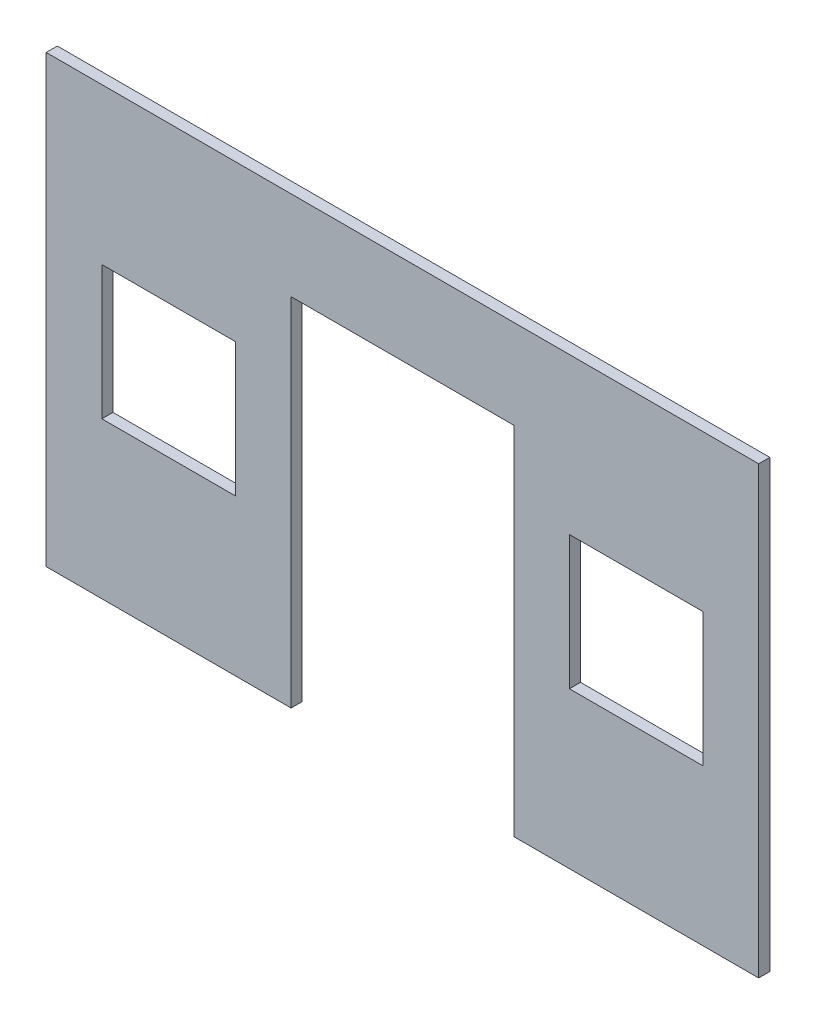
ISO-10303-21;
HEADER;
FILE_DESCRIPTION(('STEP AP214'),'2;1');
FILE_NAME('part.step','',(''),(''),'','','');
FILE_SCHEMA(('AUTOMOTIVE_DESIGN { 1 0 10303 214 1 1 1 1 }'));
ENDSEC;
DATA;
#1=APPLICATION_CONTEXT('core data for automotive mechanical design processes');
#2=APPLICATION_PROTOCOL_DEFINITION('international standard','automotive_design',2000,#1);
#3=PRODUCT_CONTEXT('',#1,'mechanical');
#4=PRODUCT('Part','Part','',(#3));
#5=PRODUCT_RELATED_PRODUCT_CATEGORY('part','',(#4));
#6=PRODUCT_DEFINITION_FORMATION('','',#4);
#7=PRODUCT_DEFINITION_CONTEXT('part definition',#1,'design');
#8=PRODUCT_DEFINITION('design','',#6,#7);
#9=PRODUCT_DEFINITION_SHAPE('','',#8);
#10=(LENGTH_UNIT() NAMED_UNIT(*) SI_UNIT(.MILLI.,.METRE.));
#11=(NAMED_UNIT(*) PLANE_ANGLE_UNIT() SI_UNIT($,.RADIAN.));
#12=(NAMED_UNIT(*) SI_UNIT($,.STERADIAN.) SOLID_ANGLE_UNIT());
#13=UNCERTAINTY_MEASURE_WITH_UNIT(LENGTH_MEASURE(1.E-05),#10,'distance_accuracy_value','');
#14=(GEOMETRIC_REPRESENTATION_CONTEXT(3) GLOBAL_UNCERTAINTY_ASSIGNED_CONTEXT((#13)) GLOBAL_UNIT_ASSIGNED_CONTEXT((#10,
#11,#12)) REPRESENTATION_CONTEXT('',''));
#15=CARTESIAN_POINT('',(0.,0.,0.));
#16=DIRECTION('',(0.,0.,1.));
#17=DIRECTION('',(1.,0.,0.));
#18=AXIS2_PLACEMENT_3D('',#15,#16,#17);
#19=CARTESIAN_POINT('',(-203.2,0.,6.35));
#20=DIRECTION('',(0.,1.,0.));
#21=DIRECTION('',(-1.,0.,0.));
#22=AXIS2_PLACEMENT_3D('',#19,#20,#21);
#23=PLANE('',#22);
#24=DIRECTION('',(1.,0.,0.));
#25=VECTOR('',#24,1.);
#26=CARTESIAN_POINT('',(-203.2,0.,0.));
#27=LINE('',#26,#25);
#28=CARTESIAN_POINT('',(-203.2,0.,0.));
#29=VERTEX_POINT('',#28);
#30=CARTESIAN_POINT('',(-63.5,0.,0.));
#31=VERTEX_POINT('',#30);
#32=EDGE_CURVE('E254',#29,#31,#27,.T.);
#33=ORIENTED_EDGE('',*,*,#32,.T.);
#34=DIRECTION('',(0.,0.,1.));
#35=VECTOR('',#34,1.);
#36=CARTESIAN_POINT('',(-63.5,0.,-0.00100000000000013));
#37=LINE('',#36,#35);
#38=CARTESIAN_POINT('',(-63.5,0.,6.35));
#39=VERTEX_POINT('',#38);
#40=EDGE_CURVE('E228',#31,#39,#37,.T.);
#41=ORIENTED_EDGE('',*,*,#40,.T.);
#42=DIRECTION('',(1.,0.,0.));
#43=VECTOR('',#42,1.);
#44=CARTESIAN_POINT('',(-203.2,0.,6.35));
#45=LINE('',#44,#43);
#46=CARTESIAN_POINT('',(-203.2,0.,6.35));
#47=VERTEX_POINT('',#46);
#48=EDGE_CURVE('E243',#47,#39,#45,.T.);
#49=ORIENTED_EDGE('',*,*,#48,.F.);
#50=DIRECTION('',(0.,0.,-1.));
#51=VECTOR('',#50,1.);
#52=CARTESIAN_POINT('',(-203.2,0.,6.35));
#53=LINE('',#52,#51);
#54=EDGE_CURVE('E11',#47,#29,#53,.T.);
#55=ORIENTED_EDGE('',*,*,#54,.T.);
#56=EDGE_LOOP('',(#33,#41,#49,#55));
#57=FACE_BOUND('',#56,.T.);
#58=ADVANCED_FACE('F33',(#57),#23,.F.);
#59=CARTESIAN_POINT('',(-203.2,254.,6.35));
#60=DIRECTION('',(1.,0.,0.));
#61=DIRECTION('',(0.,1.,0.));
#62=AXIS2_PLACEMENT_3D('',#59,#60,#61);
#63=PLANE('',#62);
#64=DIRECTION('',(0.,-1.,0.));
#65=VECTOR('',#64,1.);
#66=CARTESIAN_POINT('',(-203.2,254.,0.));
#67=LINE('',#66,#65);
#68=CARTESIAN_POINT('',(-203.2,254.,0.));
#69=VERTEX_POINT('',#68);
#70=EDGE_CURVE('E231',#69,#29,#67,.T.);
#71=ORIENTED_EDGE('',*,*,#70,.T.);
#72=ORIENTED_EDGE('',*,*,#54,.F.);
#73=DIRECTION('',(0.,-1.,0.));
#74=VECTOR('',#73,1.);
#75=CARTESIAN_POINT('',(-203.2,254.,6.35));
#76=LINE('',#75,#74);
#77=CARTESIAN_POINT('',(-203.2,254.,6.35));
#78=VERTEX_POINT('',#77);
#79=EDGE_CURVE('E238',#78,#47,#76,.T.);
#80=ORIENTED_EDGE('',*,*,#79,.F.);
#81=DIRECTION('',(0.,0.,-1.));
#82=VECTOR('',#81,1.);
#83=CARTESIAN_POINT('',(-203.2,254.,6.35));
#84=LINE('',#83,#82);
#85=EDGE_CURVE('E250',#78,#69,#84,.T.);
#86=ORIENTED_EDGE('',*,*,#85,.T.);
#87=EDGE_LOOP('',(#71,#72,#80,#86));
#88=FACE_BOUND('',#87,.T.);
#89=ADVANCED_FACE('F35',(#88),#63,.F.);
#90=CARTESIAN_POINT('',(63.5,0.,6.35));
#91=VERTEX_POINT('',#90);
#92=CARTESIAN_POINT('',(203.2,0.,6.35));
#93=VERTEX_POINT('',#92);
#94=EDGE_CURVE('E241',#91,#93,#45,.T.);
#95=ORIENTED_EDGE('',*,*,#94,.F.);
#96=DIRECTION('',(0.,0.,1.));
#97=VECTOR('',#96,1.);
#98=CARTESIAN_POINT('',(63.5,0.,-0.00100000000000013));
#99=LINE('',#98,#97);
#100=CARTESIAN_POINT('',(63.5,0.,0.));
#101=VERTEX_POINT('',#100);
#102=EDGE_CURVE('E234',#101,#91,#99,.T.);
#103=ORIENTED_EDGE('',*,*,#102,.F.);
#104=CARTESIAN_POINT('',(203.2,0.,0.));
#105=VERTEX_POINT('',#104);
#106=EDGE_CURVE('E253',#101,#105,#27,.T.);
#107=ORIENTED_EDGE('',*,*,#106,.T.);
#108=DIRECTION('',(0.,0.,-1.));
#109=VECTOR('',#108,1.);
#110=CARTESIAN_POINT('',(203.2,0.,6.35));
#111=LINE('',#110,#109);
#112=EDGE_CURVE('E41',#93,#105,#111,.T.);
#113=ORIENTED_EDGE('',*,*,#112,.F.);
#114=EDGE_LOOP('',(#95,#103,#107,#113));
#115=FACE_BOUND('',#114,.T.);
#116=ADVANCED_FACE('F292',(#115),#23,.F.);
#117=CARTESIAN_POINT('',(203.2,254.,6.35));
#118=DIRECTION('',(-1.,0.,0.));
#119=DIRECTION('',(0.,-1.,0.));
#120=AXIS2_PLACEMENT_3D('',#117,#118,#119);
#121=PLANE('',#120);
#122=DIRECTION('',(0.,1.,0.));
#123=VECTOR('',#122,1.);
#124=CARTESIAN_POINT('',(203.2,254.,0.));
#125=LINE('',#124,#123);
#126=CARTESIAN_POINT('',(203.2,254.,0.));
#127=VERTEX_POINT('',#126);
#128=EDGE_CURVE('E257',#105,#127,#125,.T.);
#129=ORIENTED_EDGE('',*,*,#128,.T.);
#130=DIRECTION('',(0.,0.,-1.));
#131=VECTOR('',#130,1.);
#132=CARTESIAN_POINT('',(203.2,254.,6.35));
#133=LINE('',#132,#131);
#134=CARTESIAN_POINT('',(203.2,254.,6.35));
#135=VERTEX_POINT('',#134);
#136=EDGE_CURVE('E262',#135,#127,#133,.T.);
#137=ORIENTED_EDGE('',*,*,#136,.F.);
#138=DIRECTION('',(0.,1.,0.));
#139=VECTOR('',#138,1.);
#140=CARTESIAN_POINT('',(203.2,254.,6.35));
#141=LINE('',#140,#139);
#142=EDGE_CURVE('E246',#93,#135,#141,.T.);
#143=ORIENTED_EDGE('',*,*,#142,.F.);
#144=ORIENTED_EDGE('',*,*,#112,.T.);
#145=EDGE_LOOP('',(#129,#137,#143,#144));
#146=FACE_BOUND('',#145,.T.);
#147=ADVANCED_FACE('F269',(#146),#121,.F.);
#148=CARTESIAN_POINT('',(-203.2,254.,6.35));
#149=DIRECTION('',(0.,-1.,0.));
#150=DIRECTION('',(1.,0.,0.));
#151=AXIS2_PLACEMENT_3D('',#148,#149,#150);
#152=PLANE('',#151);
#153=DIRECTION('',(-1.,0.,0.));
#154=VECTOR('',#153,1.);
#155=CARTESIAN_POINT('',(-203.2,254.,0.));
#156=LINE('',#155,#154);
#157=EDGE_CURVE('E242',#127,#69,#156,.T.);
#158=ORIENTED_EDGE('',*,*,#157,.T.);
#159=ORIENTED_EDGE('',*,*,#85,.F.);
#160=DIRECTION('',(-1.,0.,0.));
#161=VECTOR('',#160,1.);
#162=CARTESIAN_POINT('',(-203.2,254.,6.35));
#163=LINE('',#162,#161);
#164=EDGE_CURVE('E248',#135,#78,#163,.T.);
#165=ORIENTED_EDGE('',*,*,#164,.F.);
#166=ORIENTED_EDGE('',*,*,#136,.T.);
#167=EDGE_LOOP('',(#158,#159,#165,#166));
#168=FACE_BOUND('',#167,.T.);
#169=ADVANCED_FACE('F281',(#168),#152,.F.);
#170=CARTESIAN_POINT('',(0.,0.,6.35));
#171=DIRECTION('',(0.,0.,1.));
#172=DIRECTION('',(1.,0.,0.));
#173=AXIS2_PLACEMENT_3D('',#170,#171,#172);
#174=PLANE('',#173);
#175=DIRECTION('',(0.,-1.,0.));
#176=VECTOR('',#175,1.);
#177=CARTESIAN_POINT('',(95.25,165.1,6.35));
#178=LINE('',#177,#176);
#179=CARTESIAN_POINT('',(95.25,165.1,6.35));
#180=VERTEX_POINT('',#179);
#181=CARTESIAN_POINT('',(95.2500000000001,88.9,6.35));
#182=VERTEX_POINT('',#181);
#183=EDGE_CURVE('E48',#180,#182,#178,.T.);
#184=ORIENTED_EDGE('',*,*,#183,.F.);
#185=DIRECTION('',(-1.,0.,0.));
#186=VECTOR('',#185,1.);
#187=CARTESIAN_POINT('',(95.25,165.1,6.35));
#188=LINE('',#187,#186);
#189=CARTESIAN_POINT('',(171.45,165.1,6.35));
#190=VERTEX_POINT('',#189);
#191=EDGE_CURVE('E154',#190,#180,#188,.T.);
#192=ORIENTED_EDGE('',*,*,#191,.F.);
#193=DIRECTION('',(0.,1.,0.));
#194=VECTOR('',#193,1.);
#195=CARTESIAN_POINT('',(171.45,165.1,6.35));
#196=LINE('',#195,#194);
#197=CARTESIAN_POINT('',(171.45,88.9,6.35));
#198=VERTEX_POINT('',#197);
#199=EDGE_CURVE('E174',#198,#190,#196,.T.);
#200=ORIENTED_EDGE('',*,*,#199,.F.);
#201=DIRECTION('',(1.,0.,0.));
#202=VECTOR('',#201,1.);
#203=CARTESIAN_POINT('',(95.2500000000001,88.9,6.35));
#204=LINE('',#203,#202);
#205=EDGE_CURVE('E168',#182,#198,#204,.T.);
#206=ORIENTED_EDGE('',*,*,#205,.F.);
#207=EDGE_LOOP('',(#184,#192,#200,#206));
#208=FACE_BOUND('',#207,.T.);
#209=DIRECTION('',(0.,-1.,0.));
#210=VECTOR('',#209,1.);
#211=CARTESIAN_POINT('',(-171.45,165.1,6.35));
#212=LINE('',#211,#210);
#213=CARTESIAN_POINT('',(-171.45,165.1,6.35));
#214=VERTEX_POINT('',#213);
#215=CARTESIAN_POINT('',(-171.45,88.9,6.35));
#216=VERTEX_POINT('',#215);
#217=EDGE_CURVE('E190',#214,#216,#212,.T.);
#218=ORIENTED_EDGE('',*,*,#217,.F.);
#219=DIRECTION('',(-1.,0.,0.));
#220=VECTOR('',#219,1.);
#221=CARTESIAN_POINT('',(-171.45,165.1,6.35));
#222=LINE('',#221,#220);
#223=CARTESIAN_POINT('',(-95.25,165.1,6.35));
#224=VERTEX_POINT('',#223);
#225=EDGE_CURVE('E198',#224,#214,#222,.T.);
#226=ORIENTED_EDGE('',*,*,#225,.F.);
#227=DIRECTION('',(0.,1.,0.));
#228=VECTOR('',#227,1.);
#229=CARTESIAN_POINT('',(-95.25,165.1,6.35));
#230=LINE('',#229,#228);
#231=CARTESIAN_POINT('',(-95.25,88.9,6.35));
#232=VERTEX_POINT('',#231);
#233=EDGE_CURVE('E195',#232,#224,#230,.T.);
#234=ORIENTED_EDGE('',*,*,#233,.F.);
#235=DIRECTION('',(1.,0.,0.));
#236=VECTOR('',#235,1.);
#237=CARTESIAN_POINT('',(-171.45,88.9,6.35));
#238=LINE('',#237,#236);
#239=EDGE_CURVE('E192',#216,#232,#238,.T.);
#240=ORIENTED_EDGE('',*,*,#239,.F.);
#241=EDGE_LOOP('',(#218,#226,#234,#240));
#242=FACE_BOUND('',#241,.T.);
#243=DIRECTION('',(0.,-1.,0.));
#244=VECTOR('',#243,1.);
#245=CARTESIAN_POINT('',(-63.5,203.2,6.35));
#246=LINE('',#245,#244);
#247=CARTESIAN_POINT('',(-63.5,203.2,6.35));
#248=VERTEX_POINT('',#247);
#249=EDGE_CURVE('E220',#248,#39,#246,.T.);
#250=ORIENTED_EDGE('',*,*,#249,.F.);
#251=DIRECTION('',(-1.,0.,0.));
#252=VECTOR('',#251,1.);
#253=CARTESIAN_POINT('',(-63.5,203.2,6.35));
#254=LINE('',#253,#252);
#255=CARTESIAN_POINT('',(63.5,203.2,6.35));
#256=VERTEX_POINT('',#255);
#257=EDGE_CURVE('E225',#256,#248,#254,.T.);
#258=ORIENTED_EDGE('',*,*,#257,.F.);
#259=DIRECTION('',(0.,1.,0.));
#260=VECTOR('',#259,1.);
#261=CARTESIAN_POINT('',(63.5,203.2,6.35));
#262=LINE('',#261,#260);
#263=EDGE_CURVE('E222',#91,#256,#262,.T.);
#264=ORIENTED_EDGE('',*,*,#263,.F.);
#265=ORIENTED_EDGE('',*,*,#94,.T.);
#266=ORIENTED_EDGE('',*,*,#142,.T.);
#267=ORIENTED_EDGE('',*,*,#164,.T.);
#268=ORIENTED_EDGE('',*,*,#79,.T.);
#269=ORIENTED_EDGE('',*,*,#48,.T.);
#270=EDGE_LOOP('',(#250,#258,#264,#265,#266,#267,#268,#269));
#271=FACE_BOUND('',#270,.T.);
#272=ADVANCED_FACE('F288',(#208,#242,#271),#174,.T.);
#273=CARTESIAN_POINT('',(0.,0.,0.));
#274=DIRECTION('',(0.,0.,1.));
#275=DIRECTION('',(1.,0.,0.));
#276=AXIS2_PLACEMENT_3D('',#273,#274,#275);
#277=PLANE('',#276);
#278=DIRECTION('',(1.,0.,0.));
#279=VECTOR('',#278,1.);
#280=CARTESIAN_POINT('',(95.25,165.1,0.));
#281=LINE('',#280,#279);
#282=CARTESIAN_POINT('',(95.25,165.1,0.));
#283=VERTEX_POINT('',#282);
#284=CARTESIAN_POINT('',(171.45,165.1,0.));
#285=VERTEX_POINT('',#284);
#286=EDGE_CURVE('E166',#283,#285,#281,.T.);
#287=ORIENTED_EDGE('',*,*,#286,.F.);
#288=DIRECTION('',(0.,1.,0.));
#289=VECTOR('',#288,1.);
#290=CARTESIAN_POINT('',(95.25,165.1,0.));
#291=LINE('',#290,#289);
#292=CARTESIAN_POINT('',(95.2500000000001,88.9,0.));
#293=VERTEX_POINT('',#292);
#294=EDGE_CURVE('E148',#293,#283,#291,.T.);
#295=ORIENTED_EDGE('',*,*,#294,.F.);
#296=DIRECTION('',(-1.,0.,0.));
#297=VECTOR('',#296,1.);
#298=CARTESIAN_POINT('',(95.2500000000001,88.9,0.));
#299=LINE('',#298,#297);
#300=CARTESIAN_POINT('',(171.45,88.9,0.));
#301=VERTEX_POINT('',#300);
#302=EDGE_CURVE('E157',#301,#293,#299,.T.);
#303=ORIENTED_EDGE('',*,*,#302,.F.);
#304=DIRECTION('',(0.,-1.,0.));
#305=VECTOR('',#304,1.);
#306=CARTESIAN_POINT('',(171.45,165.1,0.));
#307=LINE('',#306,#305);
#308=EDGE_CURVE('E56',#285,#301,#307,.T.);
#309=ORIENTED_EDGE('',*,*,#308,.F.);
#310=EDGE_LOOP('',(#287,#295,#303,#309));
#311=FACE_BOUND('',#310,.T.);
#312=DIRECTION('',(1.,0.,0.));
#313=VECTOR('',#312,1.);
#314=CARTESIAN_POINT('',(-171.45,165.1,0.));
#315=LINE('',#314,#313);
#316=CARTESIAN_POINT('',(-171.45,165.1,0.));
#317=VERTEX_POINT('',#316);
#318=CARTESIAN_POINT('',(-95.25,165.1,0.));
#319=VERTEX_POINT('',#318);
#320=EDGE_CURVE('E184',#317,#319,#315,.T.);
#321=ORIENTED_EDGE('',*,*,#320,.F.);
#322=DIRECTION('',(0.,1.,0.));
#323=VECTOR('',#322,1.);
#324=CARTESIAN_POINT('',(-171.45,165.1,0.));
#325=LINE('',#324,#323);
#326=CARTESIAN_POINT('',(-171.45,88.9,0.));
#327=VERTEX_POINT('',#326);
#328=EDGE_CURVE('E187',#327,#317,#325,.T.);
#329=ORIENTED_EDGE('',*,*,#328,.F.);
#330=DIRECTION('',(-1.,0.,0.));
#331=VECTOR('',#330,1.);
#332=CARTESIAN_POINT('',(-171.45,88.9,0.));
#333=LINE('',#332,#331);
#334=CARTESIAN_POINT('',(-95.25,88.9,0.));
#335=VERTEX_POINT('',#334);
#336=EDGE_CURVE('E204',#335,#327,#333,.T.);
#337=ORIENTED_EDGE('',*,*,#336,.F.);
#338=DIRECTION('',(0.,-1.,0.));
#339=VECTOR('',#338,1.);
#340=CARTESIAN_POINT('',(-95.25,165.1,0.));
#341=LINE('',#340,#339);
#342=EDGE_CURVE('E160',#319,#335,#341,.T.);
#343=ORIENTED_EDGE('',*,*,#342,.F.);
#344=EDGE_LOOP('',(#321,#329,#337,#343));
#345=FACE_BOUND('',#344,.T.);
#346=DIRECTION('',(1.,0.,0.));
#347=VECTOR('',#346,1.);
#348=CARTESIAN_POINT('',(-63.5,203.2,0.));
#349=LINE('',#348,#347);
#350=CARTESIAN_POINT('',(-63.5,203.2,0.));
#351=VERTEX_POINT('',#350);
#352=CARTESIAN_POINT('',(63.5,203.2,0.));
#353=VERTEX_POINT('',#352);
#354=EDGE_CURVE('E215',#351,#353,#349,.T.);
#355=ORIENTED_EDGE('',*,*,#354,.F.);
#356=DIRECTION('',(0.,1.,0.));
#357=VECTOR('',#356,1.);
#358=CARTESIAN_POINT('',(-63.5,203.2,0.));
#359=LINE('',#358,#357);
#360=EDGE_CURVE('E217',#31,#351,#359,.T.);
#361=ORIENTED_EDGE('',*,*,#360,.F.);
#362=ORIENTED_EDGE('',*,*,#32,.F.);
#363=ORIENTED_EDGE('',*,*,#70,.F.);
#364=ORIENTED_EDGE('',*,*,#157,.F.);
#365=ORIENTED_EDGE('',*,*,#128,.F.);
#366=ORIENTED_EDGE('',*,*,#106,.F.);
#367=DIRECTION('',(0.,-1.,0.));
#368=VECTOR('',#367,1.);
#369=CARTESIAN_POINT('',(63.5,203.2,0.));
#370=LINE('',#369,#368);
#371=EDGE_CURVE('E213',#353,#101,#370,.T.);
#372=ORIENTED_EDGE('',*,*,#371,.F.);
#373=EDGE_LOOP('',(#355,#361,#362,#363,#364,#365,#366,#372));
#374=FACE_BOUND('',#373,.T.);
#375=ADVANCED_FACE('F163',(#311,#345,#374),#277,.F.);
#376=CARTESIAN_POINT('',(-63.5,203.2,-0.00100000000000013));
#377=DIRECTION('',(-1.,0.,0.));
#378=DIRECTION('',(0.,-1.,0.));
#379=AXIS2_PLACEMENT_3D('',#376,#377,#378);
#380=PLANE('',#379);
#381=ORIENTED_EDGE('',*,*,#360,.T.);
#382=DIRECTION('',(0.,0.,1.));
#383=VECTOR('',#382,1.);
#384=CARTESIAN_POINT('',(-63.5,203.2,-0.00100000000000013));
#385=LINE('',#384,#383);
#386=EDGE_CURVE('E229',#351,#248,#385,.T.);
#387=ORIENTED_EDGE('',*,*,#386,.T.);
#388=ORIENTED_EDGE('',*,*,#249,.T.);
#389=ORIENTED_EDGE('',*,*,#40,.F.);
#390=EDGE_LOOP('',(#381,#387,#388,#389));
#391=FACE_BOUND('',#390,.T.);
#392=ADVANCED_FACE('F300',(#391),#380,.F.);
#393=CARTESIAN_POINT('',(-63.5,203.2,-0.00100000000000013));
#394=DIRECTION('',(0.,1.,0.));
#395=DIRECTION('',(0.,0.,1.));
#396=AXIS2_PLACEMENT_3D('',#393,#394,#395);
#397=PLANE('',#396);
#398=ORIENTED_EDGE('',*,*,#354,.T.);
#399=DIRECTION('',(0.,0.,1.));
#400=VECTOR('',#399,1.);
#401=CARTESIAN_POINT('',(63.5,203.2,-0.00100000000000013));
#402=LINE('',#401,#400);
#403=EDGE_CURVE('E232',#353,#256,#402,.T.);
#404=ORIENTED_EDGE('',*,*,#403,.T.);
#405=ORIENTED_EDGE('',*,*,#257,.T.);
#406=ORIENTED_EDGE('',*,*,#386,.F.);
#407=EDGE_LOOP('',(#398,#404,#405,#406));
#408=FACE_BOUND('',#407,.T.);
#409=ADVANCED_FACE('F298',(#408),#397,.F.);
#410=CARTESIAN_POINT('',(63.5,203.2,-0.00100000000000013));
#411=DIRECTION('',(1.,0.,0.));
#412=DIRECTION('',(0.,1.,0.));
#413=AXIS2_PLACEMENT_3D('',#410,#411,#412);
#414=PLANE('',#413);
#415=ORIENTED_EDGE('',*,*,#371,.T.);
#416=ORIENTED_EDGE('',*,*,#102,.T.);
#417=ORIENTED_EDGE('',*,*,#263,.T.);
#418=ORIENTED_EDGE('',*,*,#403,.F.);
#419=EDGE_LOOP('',(#415,#416,#417,#418));
#420=FACE_BOUND('',#419,.T.);
#421=ADVANCED_FACE('F294',(#420),#414,.F.);
#422=CARTESIAN_POINT('',(-171.45,165.1,-0.00100000000000013));
#423=DIRECTION('',(-1.,0.,0.));
#424=DIRECTION('',(0.,-1.,0.));
#425=AXIS2_PLACEMENT_3D('',#422,#423,#424);
#426=PLANE('',#425);
#427=ORIENTED_EDGE('',*,*,#328,.T.);
#428=DIRECTION('',(0.,0.,1.));
#429=VECTOR('',#428,1.);
#430=CARTESIAN_POINT('',(-171.45,165.1,-0.00100000000000013));
#431=LINE('',#430,#429);
#432=EDGE_CURVE('E202',#317,#214,#431,.T.);
#433=ORIENTED_EDGE('',*,*,#432,.T.);
#434=ORIENTED_EDGE('',*,*,#217,.T.);
#435=DIRECTION('',(0.,0.,1.));
#436=VECTOR('',#435,1.);
#437=CARTESIAN_POINT('',(-171.45,88.9,-0.00100000000000013));
#438=LINE('',#437,#436);
#439=EDGE_CURVE('E201',#327,#216,#438,.T.);
#440=ORIENTED_EDGE('',*,*,#439,.F.);
#441=EDGE_LOOP('',(#427,#433,#434,#440));
#442=FACE_BOUND('',#441,.T.);
#443=ADVANCED_FACE('F325',(#442),#426,.F.);
#444=CARTESIAN_POINT('',(-171.45,165.1,-0.00100000000000013));
#445=DIRECTION('',(0.,1.,0.));
#446=DIRECTION('',(0.,0.,1.));
#447=AXIS2_PLACEMENT_3D('',#444,#445,#446);
#448=PLANE('',#447);
#449=ORIENTED_EDGE('',*,*,#320,.T.);
#450=DIRECTION('',(0.,0.,1.));
#451=VECTOR('',#450,1.);
#452=CARTESIAN_POINT('',(-95.25,165.1,-0.00100000000000013));
#453=LINE('',#452,#451);
#454=EDGE_CURVE('E205',#319,#224,#453,.T.);
#455=ORIENTED_EDGE('',*,*,#454,.T.);
#456=ORIENTED_EDGE('',*,*,#225,.T.);
#457=ORIENTED_EDGE('',*,*,#432,.F.);
#458=EDGE_LOOP('',(#449,#455,#456,#457));
#459=FACE_BOUND('',#458,.T.);
#460=ADVANCED_FACE('F330',(#459),#448,.F.);
#461=CARTESIAN_POINT('',(-95.25,165.1,-0.00100000000000013));
#462=DIRECTION('',(1.,0.,0.));
#463=DIRECTION('',(0.,1.,0.));
#464=AXIS2_PLACEMENT_3D('',#461,#462,#463);
#465=PLANE('',#464);
#466=ORIENTED_EDGE('',*,*,#342,.T.);
#467=DIRECTION('',(0.,0.,1.));
#468=VECTOR('',#467,1.);
#469=CARTESIAN_POINT('',(-95.25,88.9,-0.00100000000000013));
#470=LINE('',#469,#468);
#471=EDGE_CURVE('E207',#335,#232,#470,.T.);
#472=ORIENTED_EDGE('',*,*,#471,.T.);
#473=ORIENTED_EDGE('',*,*,#233,.T.);
#474=ORIENTED_EDGE('',*,*,#454,.F.);
#475=EDGE_LOOP('',(#466,#472,#473,#474));
#476=FACE_BOUND('',#475,.T.);
#477=ADVANCED_FACE('F335',(#476),#465,.F.);
#478=CARTESIAN_POINT('',(-171.45,88.9,-0.00100000000000013));
#479=DIRECTION('',(0.,-1.,0.));
#480=DIRECTION('',(0.,0.,-1.));
#481=AXIS2_PLACEMENT_3D('',#478,#479,#480);
#482=PLANE('',#481);
#483=ORIENTED_EDGE('',*,*,#336,.T.);
#484=ORIENTED_EDGE('',*,*,#439,.T.);
#485=ORIENTED_EDGE('',*,*,#239,.T.);
#486=ORIENTED_EDGE('',*,*,#471,.F.);
#487=EDGE_LOOP('',(#483,#484,#485,#486));
#488=FACE_BOUND('',#487,.T.);
#489=ADVANCED_FACE('F332',(#488),#482,.F.);
#490=CARTESIAN_POINT('',(95.25,165.1,-0.00100000000000013));
#491=DIRECTION('',(-1.,0.,0.));
#492=DIRECTION('',(0.,-1.,0.));
#493=AXIS2_PLACEMENT_3D('',#490,#491,#492);
#494=PLANE('',#493);
#495=ORIENTED_EDGE('',*,*,#294,.T.);
#496=DIRECTION('',(0.,0.,1.));
#497=VECTOR('',#496,1.);
#498=CARTESIAN_POINT('',(95.25,165.1,-0.00100000000000013));
#499=LINE('',#498,#497);
#500=EDGE_CURVE('E161',#283,#180,#499,.T.);
#501=ORIENTED_EDGE('',*,*,#500,.T.);
#502=ORIENTED_EDGE('',*,*,#183,.T.);
#503=DIRECTION('',(0.,0.,1.));
#504=VECTOR('',#503,1.);
#505=CARTESIAN_POINT('',(95.2500000000001,88.9,-0.00100000000000013));
#506=LINE('',#505,#504);
#507=EDGE_CURVE('E144',#293,#182,#506,.T.);
#508=ORIENTED_EDGE('',*,*,#507,.F.);
#509=EDGE_LOOP('',(#495,#501,#502,#508));
#510=FACE_BOUND('',#509,.T.);
#511=ADVANCED_FACE('F146',(#510),#494,.F.);
#512=CARTESIAN_POINT('',(95.25,165.1,-0.00100000000000013));
#513=DIRECTION('',(0.,1.,0.));
#514=DIRECTION('',(0.,0.,1.));
#515=AXIS2_PLACEMENT_3D('',#512,#513,#514);
#516=PLANE('',#515);
#517=ORIENTED_EDGE('',*,*,#286,.T.);
#518=DIRECTION('',(0.,0.,1.));
#519=VECTOR('',#518,1.);
#520=CARTESIAN_POINT('',(171.45,165.1,-0.00100000000000013));
#521=LINE('',#520,#519);
#522=EDGE_CURVE('E180',#285,#190,#521,.T.);
#523=ORIENTED_EDGE('',*,*,#522,.T.);
#524=ORIENTED_EDGE('',*,*,#191,.T.);
#525=ORIENTED_EDGE('',*,*,#500,.F.);
#526=EDGE_LOOP('',(#517,#523,#524,#525));
#527=FACE_BOUND('',#526,.T.);
#528=ADVANCED_FACE('F345',(#527),#516,.F.);
#529=CARTESIAN_POINT('',(171.45,165.1,-0.00100000000000013));
#530=DIRECTION('',(1.,0.,0.));
#531=DIRECTION('',(0.,1.,0.));
#532=AXIS2_PLACEMENT_3D('',#529,#530,#531);
#533=PLANE('',#532);
#534=ORIENTED_EDGE('',*,*,#308,.T.);
#535=DIRECTION('',(0.,0.,1.));
#536=VECTOR('',#535,1.);
#537=CARTESIAN_POINT('',(171.45,88.9,-0.00100000000000013));
#538=LINE('',#537,#536);
#539=EDGE_CURVE('E153',#301,#198,#538,.T.);
#540=ORIENTED_EDGE('',*,*,#539,.T.);
#541=ORIENTED_EDGE('',*,*,#199,.T.);
#542=ORIENTED_EDGE('',*,*,#522,.F.);
#543=EDGE_LOOP('',(#534,#540,#541,#542));
#544=FACE_BOUND('',#543,.T.);
#545=ADVANCED_FACE('F348',(#544),#533,.F.);
#546=CARTESIAN_POINT('',(95.2500000000001,88.9,-0.00100000000000013));
#547=DIRECTION('',(0.,-1.,0.));
#548=DIRECTION('',(1.,0.,0.));
#549=AXIS2_PLACEMENT_3D('',#546,#547,#548);
#550=PLANE('',#549);
#551=ORIENTED_EDGE('',*,*,#302,.T.);
#552=ORIENTED_EDGE('',*,*,#507,.T.);
#553=ORIENTED_EDGE('',*,*,#205,.T.);
#554=ORIENTED_EDGE('',*,*,#539,.F.);
#555=EDGE_LOOP('',(#551,#552,#553,#554));
#556=FACE_BOUND('',#555,.T.);
#557=ADVANCED_FACE('F158',(#556),#550,.F.);
#558=CLOSED_SHELL('',(#58,#89,#116,#147,#169,#272,#375,#392,#409,#421,#443,#460,#477,#489,#511,
#528,#545,#557));
#559=MANIFOLD_SOLID_BREP('B2',#558);
#560=ADVANCED_BREP_SHAPE_REPRESENTATION('',(#18,#559),#14);
#561=SHAPE_DEFINITION_REPRESENTATION(#9,#560);
ENDSEC;
END-ISO-10303-21;
